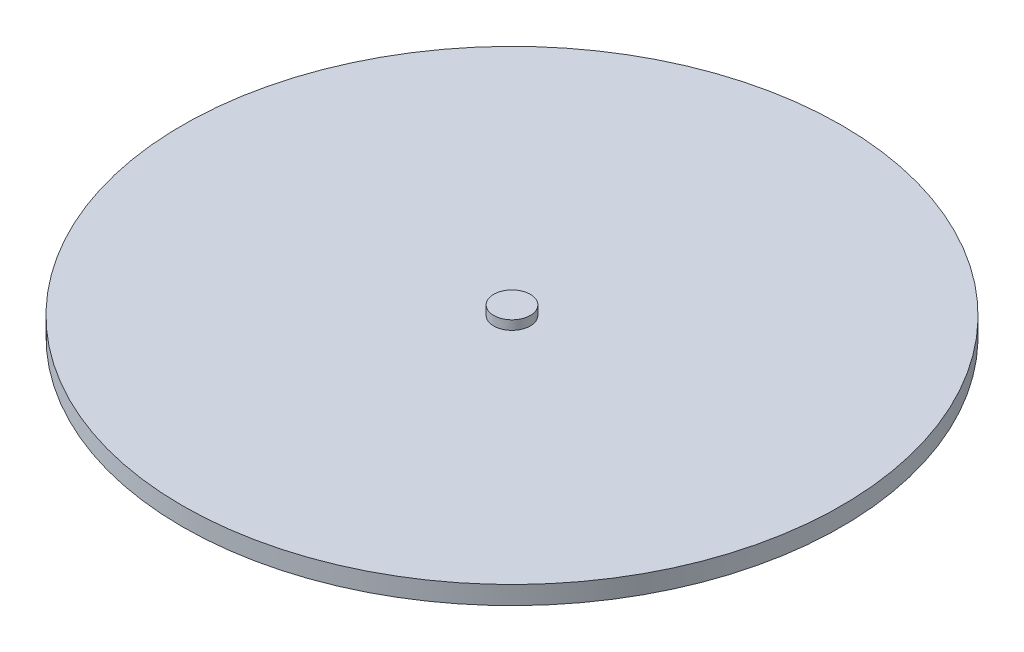
ISO-10303-21;
HEADER;
FILE_DESCRIPTION(('STEP AP214'),'2;1');
FILE_NAME('part.step','',(''),(''),'','','');
FILE_SCHEMA(('AUTOMOTIVE_DESIGN { 1 0 10303 214 1 1 1 1 }'));
ENDSEC;
DATA;
#1=APPLICATION_CONTEXT('core data for automotive mechanical design processes');
#2=APPLICATION_PROTOCOL_DEFINITION('international standard','automotive_design',2000,#1);
#3=PRODUCT_CONTEXT('',#1,'mechanical');
#4=PRODUCT('Part','Part','',(#3));
#5=PRODUCT_RELATED_PRODUCT_CATEGORY('part','',(#4));
#6=PRODUCT_DEFINITION_FORMATION('','',#4);
#7=PRODUCT_DEFINITION_CONTEXT('part definition',#1,'design');
#8=PRODUCT_DEFINITION('design','',#6,#7);
#9=PRODUCT_DEFINITION_SHAPE('','',#8);
#10=(LENGTH_UNIT() NAMED_UNIT(*) SI_UNIT(.MILLI.,.METRE.));
#11=(NAMED_UNIT(*) PLANE_ANGLE_UNIT() SI_UNIT($,.RADIAN.));
#12=(NAMED_UNIT(*) SI_UNIT($,.STERADIAN.) SOLID_ANGLE_UNIT());
#13=UNCERTAINTY_MEASURE_WITH_UNIT(LENGTH_MEASURE(1.E-05),#10,'distance_accuracy_value','');
#14=(GEOMETRIC_REPRESENTATION_CONTEXT(3) GLOBAL_UNCERTAINTY_ASSIGNED_CONTEXT((#13)) GLOBAL_UNIT_ASSIGNED_CONTEXT((#10,
#11,#12)) REPRESENTATION_CONTEXT('',''));
#15=CARTESIAN_POINT('',(0.,0.,0.));
#16=DIRECTION('',(0.,0.,1.));
#17=DIRECTION('',(1.,0.,0.));
#18=AXIS2_PLACEMENT_3D('',#15,#16,#17);
#19=CARTESIAN_POINT('',(0.,6.35,0.));
#20=DIRECTION('',(0.,1.,0.));
#21=DIRECTION('',(0.,0.,1.));
#22=AXIS2_PLACEMENT_3D('',#19,#20,#21);
#23=PLANE('',#22);
#24=CARTESIAN_POINT('',(0.,6.35,0.));
#25=DIRECTION('',(0.,1.,0.));
#26=DIRECTION('',(0.,0.,1.));
#27=AXIS2_PLACEMENT_3D('',#24,#25,#26);
#28=CIRCLE('',#27,228.6);
#29=CARTESIAN_POINT('',(0.,6.35,228.6));
#30=VERTEX_POINT('',#29);
#31=EDGE_CURVE('E10',#30,#30,#28,.T.);
#32=ORIENTED_EDGE('',*,*,#31,.T.);
#33=EDGE_LOOP('',(#32));
#34=FACE_BOUND('',#33,.T.);
#35=CARTESIAN_POINT('',(0.,6.35,0.));
#36=DIRECTION('',(0.,1.,0.));
#37=DIRECTION('',(0.,0.,1.));
#38=AXIS2_PLACEMENT_3D('',#35,#36,#37);
#39=CIRCLE('',#38,12.7);
#40=CARTESIAN_POINT('',(0.,6.35,12.7));
#41=VERTEX_POINT('',#40);
#42=EDGE_CURVE('E47',#41,#41,#39,.T.);
#43=ORIENTED_EDGE('',*,*,#42,.F.);
#44=EDGE_LOOP('',(#43));
#45=FACE_BOUND('',#44,.T.);
#46=ADVANCED_FACE('F34',(#34,#45),#23,.T.);
#47=CARTESIAN_POINT('',(0.,6.35,0.));
#48=DIRECTION('',(0.,-1.,0.));
#49=DIRECTION('',(0.,0.,-1.));
#50=AXIS2_PLACEMENT_3D('',#47,#48,#49);
#51=CYLINDRICAL_SURFACE('',#50,228.6);
#52=ORIENTED_EDGE('',*,*,#31,.F.);
#53=EDGE_LOOP('',(#52));
#54=FACE_BOUND('',#53,.T.);
#55=CARTESIAN_POINT('',(0.,-6.35,0.));
#56=DIRECTION('',(0.,1.,0.));
#57=DIRECTION('',(0.,0.,1.));
#58=AXIS2_PLACEMENT_3D('',#55,#56,#57);
#59=CIRCLE('',#58,228.6);
#60=CARTESIAN_POINT('',(0.,-6.35,228.6));
#61=VERTEX_POINT('',#60);
#62=EDGE_CURVE('E38',#61,#61,#59,.T.);
#63=ORIENTED_EDGE('',*,*,#62,.T.);
#64=EDGE_LOOP('',(#63));
#65=FACE_BOUND('',#64,.T.);
#66=ADVANCED_FACE('F36',(#54,#65),#51,.T.);
#67=CARTESIAN_POINT('',(0.,-6.35,0.));
#68=DIRECTION('',(0.,1.,0.));
#69=DIRECTION('',(0.,0.,1.));
#70=AXIS2_PLACEMENT_3D('',#67,#68,#69);
#71=PLANE('',#70);
#72=ORIENTED_EDGE('',*,*,#62,.F.);
#73=EDGE_LOOP('',(#72));
#74=FACE_BOUND('',#73,.T.);
#75=ADVANCED_FACE('F58',(#74),#71,.F.);
#76=CARTESIAN_POINT('',(0.,12.7,0.));
#77=DIRECTION('',(0.,-1.,0.));
#78=DIRECTION('',(0.,0.,-1.));
#79=AXIS2_PLACEMENT_3D('',#76,#77,#78);
#80=CYLINDRICAL_SURFACE('',#79,12.7);
#81=CARTESIAN_POINT('',(0.,12.7,0.));
#82=DIRECTION('',(0.,1.,0.));
#83=DIRECTION('',(0.,0.,1.));
#84=AXIS2_PLACEMENT_3D('',#81,#82,#83);
#85=CIRCLE('',#84,12.7);
#86=CARTESIAN_POINT('',(0.,12.7,12.7));
#87=VERTEX_POINT('',#86);
#88=EDGE_CURVE('E45',#87,#87,#85,.T.);
#89=ORIENTED_EDGE('',*,*,#88,.F.);
#90=EDGE_LOOP('',(#89));
#91=FACE_BOUND('',#90,.T.);
#92=ORIENTED_EDGE('',*,*,#42,.T.);
#93=EDGE_LOOP('',(#92));
#94=FACE_BOUND('',#93,.T.);
#95=ADVANCED_FACE('F55',(#91,#94),#80,.T.);
#96=CARTESIAN_POINT('',(0.,12.7,0.));
#97=DIRECTION('',(0.,1.,0.));
#98=DIRECTION('',(0.,0.,1.));
#99=AXIS2_PLACEMENT_3D('',#96,#97,#98);
#100=PLANE('',#99);
#101=ORIENTED_EDGE('',*,*,#88,.T.);
#102=EDGE_LOOP('',(#101));
#103=FACE_BOUND('',#102,.T.);
#104=ADVANCED_FACE('F53',(#103),#100,.T.);
#105=CLOSED_SHELL('',(#46,#66,#75,#95,#104));
#106=MANIFOLD_SOLID_BREP('B2',#105);
#107=ADVANCED_BREP_SHAPE_REPRESENTATION('',(#18,#106),#14);
#108=SHAPE_DEFINITION_REPRESENTATION(#9,#107);
ENDSEC;
END-ISO-10303-21;
